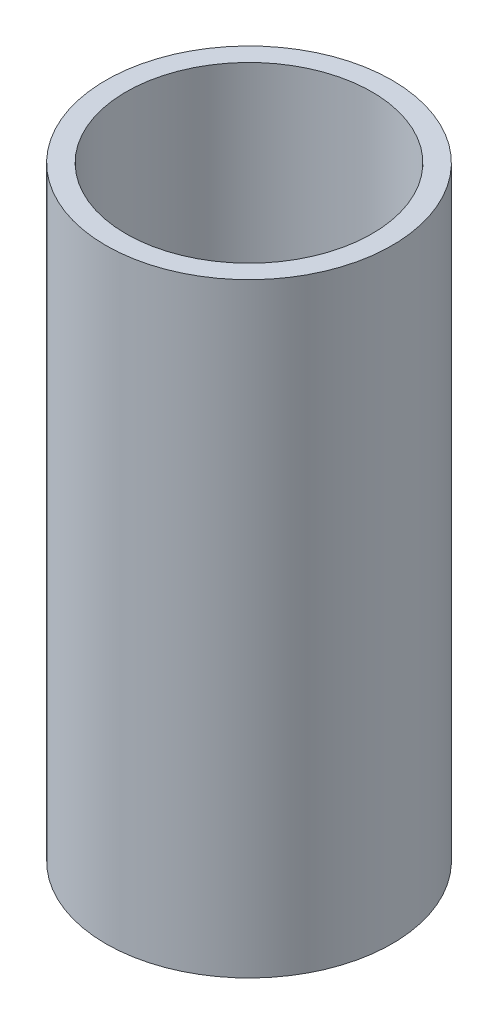
ISO-10303-21;
HEADER;
FILE_DESCRIPTION(('STEP AP214'),'2;1');
FILE_NAME('part.step','',(''),(''),'','','');
FILE_SCHEMA(('AUTOMOTIVE_DESIGN { 1 0 10303 214 1 1 1 1 }'));
ENDSEC;
DATA;
#1=APPLICATION_CONTEXT('core data for automotive mechanical design processes');
#2=APPLICATION_PROTOCOL_DEFINITION('international standard','automotive_design',2000,#1);
#3=PRODUCT_CONTEXT('',#1,'mechanical');
#4=PRODUCT('Part','Part','',(#3));
#5=PRODUCT_RELATED_PRODUCT_CATEGORY('part','',(#4));
#6=PRODUCT_DEFINITION_FORMATION('','',#4);
#7=PRODUCT_DEFINITION_CONTEXT('part definition',#1,'design');
#8=PRODUCT_DEFINITION('design','',#6,#7);
#9=PRODUCT_DEFINITION_SHAPE('','',#8);
#10=(LENGTH_UNIT() NAMED_UNIT(*) SI_UNIT(.MILLI.,.METRE.));
#11=(NAMED_UNIT(*) PLANE_ANGLE_UNIT() SI_UNIT($,.RADIAN.));
#12=(NAMED_UNIT(*) SI_UNIT($,.STERADIAN.) SOLID_ANGLE_UNIT());
#13=UNCERTAINTY_MEASURE_WITH_UNIT(LENGTH_MEASURE(1.E-05),#10,'distance_accuracy_value','');
#14=(GEOMETRIC_REPRESENTATION_CONTEXT(3) GLOBAL_UNCERTAINTY_ASSIGNED_CONTEXT((#13)) GLOBAL_UNIT_ASSIGNED_CONTEXT((#10,
#11,#12)) REPRESENTATION_CONTEXT('',''));
#15=CARTESIAN_POINT('',(0.,0.,0.));
#16=DIRECTION('',(0.,0.,1.));
#17=DIRECTION('',(1.,0.,0.));
#18=AXIS2_PLACEMENT_3D('',#15,#16,#17);
#19=CARTESIAN_POINT('',(0.,30.,0.));
#20=DIRECTION('',(0.,1.,0.));
#21=DIRECTION('',(0.,0.,1.));
#22=AXIS2_PLACEMENT_3D('',#19,#20,#21);
#23=PLANE('',#22);
#24=CARTESIAN_POINT('',(0.,30.,0.));
#25=DIRECTION('',(0.,1.,0.));
#26=DIRECTION('',(0.,0.,1.));
#27=AXIS2_PLACEMENT_3D('',#24,#25,#26);
#28=CIRCLE('',#27,7.1);
#29=CARTESIAN_POINT('',(0.,30.,7.1));
#30=VERTEX_POINT('',#29);
#31=EDGE_CURVE('E10',#30,#30,#28,.T.);
#32=ORIENTED_EDGE('',*,*,#31,.T.);
#33=EDGE_LOOP('',(#32));
#34=FACE_BOUND('',#33,.T.);
#35=CARTESIAN_POINT('',(0.,30.,0.));
#36=DIRECTION('',(0.,1.,0.));
#37=DIRECTION('',(0.,0.,1.));
#38=AXIS2_PLACEMENT_3D('',#35,#36,#37);
#39=CIRCLE('',#38,6.1);
#40=CARTESIAN_POINT('',(0.,30.,6.1));
#41=VERTEX_POINT('',#40);
#42=EDGE_CURVE('E50',#41,#41,#39,.T.);
#43=ORIENTED_EDGE('',*,*,#42,.F.);
#44=EDGE_LOOP('',(#43));
#45=FACE_BOUND('',#44,.T.);
#46=ADVANCED_FACE('F37',(#34,#45),#23,.T.);
#47=CARTESIAN_POINT('',(0.,0.,0.));
#48=DIRECTION('',(0.,1.,0.));
#49=DIRECTION('',(0.,0.,1.));
#50=AXIS2_PLACEMENT_3D('',#47,#48,#49);
#51=PLANE('',#50);
#52=CARTESIAN_POINT('',(0.,0.,0.));
#53=DIRECTION('',(0.,1.,0.));
#54=DIRECTION('',(0.,0.,1.));
#55=AXIS2_PLACEMENT_3D('',#52,#53,#54);
#56=CIRCLE('',#55,7.1);
#57=CARTESIAN_POINT('',(0.,0.,7.1));
#58=VERTEX_POINT('',#57);
#59=EDGE_CURVE('E41',#58,#58,#56,.T.);
#60=ORIENTED_EDGE('',*,*,#59,.F.);
#61=EDGE_LOOP('',(#60));
#62=FACE_BOUND('',#61,.T.);
#63=CARTESIAN_POINT('',(0.,0.,0.));
#64=DIRECTION('',(0.,1.,0.));
#65=DIRECTION('',(0.,0.,1.));
#66=AXIS2_PLACEMENT_3D('',#63,#64,#65);
#67=CIRCLE('',#66,6.1);
#68=CARTESIAN_POINT('',(0.,0.,6.1));
#69=VERTEX_POINT('',#68);
#70=EDGE_CURVE('E52',#69,#69,#67,.T.);
#71=ORIENTED_EDGE('',*,*,#70,.T.);
#72=EDGE_LOOP('',(#71));
#73=FACE_BOUND('',#72,.T.);
#74=ADVANCED_FACE('F64',(#62,#73),#51,.F.);
#75=CARTESIAN_POINT('',(0.,30.,0.));
#76=DIRECTION('',(0.,-1.,0.));
#77=DIRECTION('',(0.,0.,-1.));
#78=AXIS2_PLACEMENT_3D('',#75,#76,#77);
#79=CYLINDRICAL_SURFACE('',#78,7.1);
#80=ORIENTED_EDGE('',*,*,#31,.F.);
#81=EDGE_LOOP('',(#80));
#82=FACE_BOUND('',#81,.T.);
#83=ORIENTED_EDGE('',*,*,#59,.T.);
#84=EDGE_LOOP('',(#83));
#85=FACE_BOUND('',#84,.T.);
#86=ADVANCED_FACE('F39',(#82,#85),#79,.T.);
#87=CARTESIAN_POINT('',(0.,30.,0.));
#88=DIRECTION('',(0.,-1.,0.));
#89=DIRECTION('',(0.,0.,-1.));
#90=AXIS2_PLACEMENT_3D('',#87,#88,#89);
#91=CYLINDRICAL_SURFACE('',#90,6.1);
#92=ORIENTED_EDGE('',*,*,#42,.T.);
#93=EDGE_LOOP('',(#92));
#94=FACE_BOUND('',#93,.T.);
#95=ORIENTED_EDGE('',*,*,#70,.F.);
#96=EDGE_LOOP('',(#95));
#97=FACE_BOUND('',#96,.T.);
#98=ADVANCED_FACE('F60',(#94,#97),#91,.F.);
#99=CLOSED_SHELL('',(#46,#74,#86,#98));
#100=MANIFOLD_SOLID_BREP('B2',#99);
#101=ADVANCED_BREP_SHAPE_REPRESENTATION('',(#18,#100),#14);
#102=SHAPE_DEFINITION_REPRESENTATION(#9,#101);
ENDSEC;
END-ISO-10303-21;
